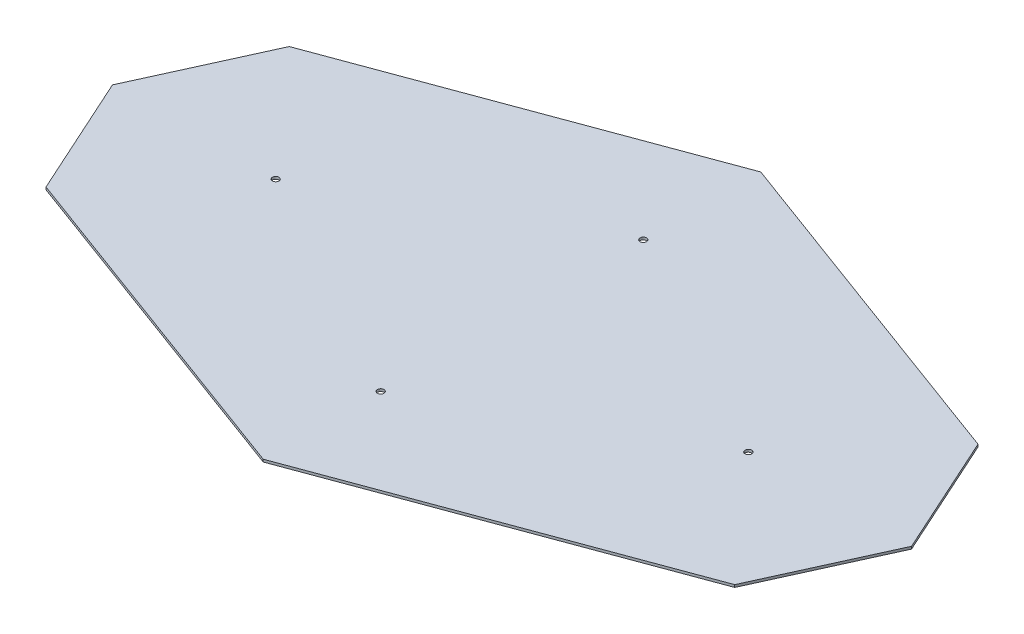
ISO-10303-21;
HEADER;
FILE_DESCRIPTION(('STEP AP214'),'2;1');
FILE_NAME('part.step','',(''),(''),'','','');
FILE_SCHEMA(('AUTOMOTIVE_DESIGN { 1 0 10303 214 1 1 1 1 }'));
ENDSEC;
DATA;
#1=APPLICATION_CONTEXT('core data for automotive mechanical design processes');
#2=APPLICATION_PROTOCOL_DEFINITION('international standard','automotive_design',2000,#1);
#3=PRODUCT_CONTEXT('',#1,'mechanical');
#4=PRODUCT('Part','Part','',(#3));
#5=PRODUCT_RELATED_PRODUCT_CATEGORY('part','',(#4));
#6=PRODUCT_DEFINITION_FORMATION('','',#4);
#7=PRODUCT_DEFINITION_CONTEXT('part definition',#1,'design');
#8=PRODUCT_DEFINITION('design','',#6,#7);
#9=PRODUCT_DEFINITION_SHAPE('','',#8);
#10=(LENGTH_UNIT() NAMED_UNIT(*) SI_UNIT(.MILLI.,.METRE.));
#11=(NAMED_UNIT(*) PLANE_ANGLE_UNIT() SI_UNIT($,.RADIAN.));
#12=(NAMED_UNIT(*) SI_UNIT($,.STERADIAN.) SOLID_ANGLE_UNIT());
#13=UNCERTAINTY_MEASURE_WITH_UNIT(LENGTH_MEASURE(1.E-05),#10,'distance_accuracy_value','');
#14=(GEOMETRIC_REPRESENTATION_CONTEXT(3) GLOBAL_UNCERTAINTY_ASSIGNED_CONTEXT((#13)) GLOBAL_UNIT_ASSIGNED_CONTEXT((#10,
#11,#12)) REPRESENTATION_CONTEXT('',''));
#15=CARTESIAN_POINT('',(0.,0.,0.));
#16=DIRECTION('',(0.,0.,1.));
#17=DIRECTION('',(1.,0.,0.));
#18=AXIS2_PLACEMENT_3D('',#15,#16,#17);
#19=CARTESIAN_POINT('',(-386.459013783552,1.190625,0.));
#20=DIRECTION('',(0.910635035926992,0.,0.413211606011068));
#21=DIRECTION('',(0.413211606011068,0.,-0.910635035926992));
#22=AXIS2_PLACEMENT_3D('',#19,#20,#21);
#23=PLANE('',#22);
#24=DIRECTION('',(-0.413211606011068,0.,0.910635035926992));
#25=VECTOR('',#24,1.);
#26=CARTESIAN_POINT('',(-386.459013783552,-1.190625,0.));
#27=LINE('',#26,#25);
#28=CARTESIAN_POINT('',(-333.074526412795,-1.190625,-117.648642650931));
#29=VERTEX_POINT('',#28);
#30=CARTESIAN_POINT('',(-386.459013783552,-1.190625,0.));
#31=VERTEX_POINT('',#30);
#32=EDGE_CURVE('E131',#29,#31,#27,.T.);
#33=ORIENTED_EDGE('',*,*,#32,.T.);
#34=DIRECTION('',(0.,-1.,0.));
#35=VECTOR('',#34,1.);
#36=CARTESIAN_POINT('',(-386.459013783552,1.190625,0.));
#37=LINE('',#36,#35);
#38=CARTESIAN_POINT('',(-386.459013783552,1.190625,0.));
#39=VERTEX_POINT('',#38);
#40=EDGE_CURVE('E11',#39,#31,#37,.T.);
#41=ORIENTED_EDGE('',*,*,#40,.F.);
#42=DIRECTION('',(-0.413211606011068,0.,0.910635035926992));
#43=VECTOR('',#42,1.);
#44=CARTESIAN_POINT('',(-386.459013783552,1.190625,0.));
#45=LINE('',#44,#43);
#46=CARTESIAN_POINT('',(-333.074526412795,1.190625,-117.648642650931));
#47=VERTEX_POINT('',#46);
#48=EDGE_CURVE('E146',#47,#39,#45,.T.);
#49=ORIENTED_EDGE('',*,*,#48,.F.);
#50=DIRECTION('',(0.,-1.,0.));
#51=VECTOR('',#50,1.);
#52=CARTESIAN_POINT('',(-333.074526412795,1.190625,-117.648642650931));
#53=LINE('',#52,#51);
#54=EDGE_CURVE('E127',#47,#29,#53,.T.);
#55=ORIENTED_EDGE('',*,*,#54,.T.);
#56=EDGE_LOOP('',(#33,#41,#49,#55));
#57=FACE_BOUND('',#56,.T.);
#58=ADVANCED_FACE('F35',(#57),#23,.F.);
#59=CARTESIAN_POINT('',(-386.459013783552,1.190625,0.));
#60=DIRECTION('',(0.910635035926992,0.,-0.413211606011068));
#61=DIRECTION('',(-0.413211606011068,0.,-0.910635035926992));
#62=AXIS2_PLACEMENT_3D('',#59,#60,#61);
#63=PLANE('',#62);
#64=DIRECTION('',(0.413211606011068,0.,0.910635035926992));
#65=VECTOR('',#64,1.);
#66=CARTESIAN_POINT('',(-386.459013783552,-1.190625,0.));
#67=LINE('',#66,#65);
#68=CARTESIAN_POINT('',(-333.074526412795,-1.190625,117.648642650931));
#69=VERTEX_POINT('',#68);
#70=EDGE_CURVE('E134',#31,#69,#67,.T.);
#71=ORIENTED_EDGE('',*,*,#70,.T.);
#72=DIRECTION('',(0.,-1.,0.));
#73=VECTOR('',#72,1.);
#74=CARTESIAN_POINT('',(-333.074526412795,1.190625,117.648642650931));
#75=LINE('',#74,#73);
#76=CARTESIAN_POINT('',(-333.074526412795,1.190625,117.648642650931));
#77=VERTEX_POINT('',#76);
#78=EDGE_CURVE('E43',#77,#69,#75,.T.);
#79=ORIENTED_EDGE('',*,*,#78,.F.);
#80=DIRECTION('',(0.413211606011068,0.,0.910635035926992));
#81=VECTOR('',#80,1.);
#82=CARTESIAN_POINT('',(-386.459013783552,1.190625,0.));
#83=LINE('',#82,#81);
#84=EDGE_CURVE('E94',#39,#77,#83,.T.);
#85=ORIENTED_EDGE('',*,*,#84,.F.);
#86=ORIENTED_EDGE('',*,*,#40,.T.);
#87=EDGE_LOOP('',(#71,#79,#85,#86));
#88=FACE_BOUND('',#87,.T.);
#89=ADVANCED_FACE('F236',(#88),#63,.F.);
#90=CARTESIAN_POINT('',(0.,1.190625,240.59792646948));
#91=DIRECTION('',(0.346294567064101,0.,-0.938125829951338));
#92=DIRECTION('',(-0.938125829951338,0.,-0.346294567064101));
#93=AXIS2_PLACEMENT_3D('',#90,#91,#92);
#94=PLANE('',#93);
#95=DIRECTION('',(0.938125829951338,0.,0.346294567064101));
#96=VECTOR('',#95,1.);
#97=CARTESIAN_POINT('',(0.,-1.190625,240.59792646948));
#98=LINE('',#97,#96);
#99=CARTESIAN_POINT('',(0.,-1.190625,240.59792646948));
#100=VERTEX_POINT('',#99);
#101=EDGE_CURVE('E137',#69,#100,#98,.T.);
#102=ORIENTED_EDGE('',*,*,#101,.T.);
#103=DIRECTION('',(0.,-1.,0.));
#104=VECTOR('',#103,1.);
#105=CARTESIAN_POINT('',(0.,1.190625,240.59792646948));
#106=LINE('',#105,#104);
#107=CARTESIAN_POINT('',(0.,1.190625,240.59792646948));
#108=VERTEX_POINT('',#107);
#109=EDGE_CURVE('E153',#108,#100,#106,.T.);
#110=ORIENTED_EDGE('',*,*,#109,.F.);
#111=DIRECTION('',(0.938125829951338,0.,0.346294567064101));
#112=VECTOR('',#111,1.);
#113=CARTESIAN_POINT('',(0.,1.190625,240.59792646948));
#114=LINE('',#113,#112);
#115=EDGE_CURVE('E161',#77,#108,#114,.T.);
#116=ORIENTED_EDGE('',*,*,#115,.F.);
#117=ORIENTED_EDGE('',*,*,#78,.T.);
#118=EDGE_LOOP('',(#102,#110,#116,#117));
#119=FACE_BOUND('',#118,.T.);
#120=ADVANCED_FACE('F159',(#119),#94,.F.);
#121=CARTESIAN_POINT('',(333.074526412795,1.190625,117.648642650931));
#122=DIRECTION('',(-0.3462945670641,0.,-0.938125829951338));
#123=DIRECTION('',(-0.938125829951338,0.,0.3462945670641));
#124=AXIS2_PLACEMENT_3D('',#121,#122,#123);
#125=PLANE('',#124);
#126=DIRECTION('',(0.938125829951338,0.,-0.346294567064101));
#127=VECTOR('',#126,1.);
#128=CARTESIAN_POINT('',(333.074526412795,-1.190625,117.648642650931));
#129=LINE('',#128,#127);
#130=CARTESIAN_POINT('',(333.074526412795,-1.190625,117.648642650931));
#131=VERTEX_POINT('',#130);
#132=EDGE_CURVE('E139',#100,#131,#129,.T.);
#133=ORIENTED_EDGE('',*,*,#132,.T.);
#134=DIRECTION('',(0.,-1.,0.));
#135=VECTOR('',#134,1.);
#136=CARTESIAN_POINT('',(333.074526412795,1.190625,117.648642650931));
#137=LINE('',#136,#135);
#138=CARTESIAN_POINT('',(333.074526412795,1.190625,117.648642650931));
#139=VERTEX_POINT('',#138);
#140=EDGE_CURVE('E150',#139,#131,#137,.T.);
#141=ORIENTED_EDGE('',*,*,#140,.F.);
#142=DIRECTION('',(0.938125829951338,0.,-0.346294567064101));
#143=VECTOR('',#142,1.);
#144=CARTESIAN_POINT('',(333.074526412795,1.190625,117.648642650931));
#145=LINE('',#144,#143);
#146=EDGE_CURVE('E173',#108,#139,#145,.T.);
#147=ORIENTED_EDGE('',*,*,#146,.F.);
#148=ORIENTED_EDGE('',*,*,#109,.T.);
#149=EDGE_LOOP('',(#133,#141,#147,#148));
#150=FACE_BOUND('',#149,.T.);
#151=ADVANCED_FACE('F169',(#150),#125,.F.);
#152=CARTESIAN_POINT('',(386.459013783552,1.190625,0.));
#153=DIRECTION('',(-0.910635035926992,0.,-0.413211606011068));
#154=DIRECTION('',(-0.413211606011068,0.,0.910635035926992));
#155=AXIS2_PLACEMENT_3D('',#152,#153,#154);
#156=PLANE('',#155);
#157=DIRECTION('',(0.413211606011068,0.,-0.910635035926992));
#158=VECTOR('',#157,1.);
#159=CARTESIAN_POINT('',(386.459013783552,-1.190625,0.));
#160=LINE('',#159,#158);
#161=CARTESIAN_POINT('',(386.459013783552,-1.190625,0.));
#162=VERTEX_POINT('',#161);
#163=EDGE_CURVE('E141',#131,#162,#160,.T.);
#164=ORIENTED_EDGE('',*,*,#163,.T.);
#165=DIRECTION('',(0.,-1.,0.));
#166=VECTOR('',#165,1.);
#167=CARTESIAN_POINT('',(386.459013783552,1.190625,0.));
#168=LINE('',#167,#166);
#169=CARTESIAN_POINT('',(386.459013783552,1.190625,0.));
#170=VERTEX_POINT('',#169);
#171=EDGE_CURVE('E122',#170,#162,#168,.T.);
#172=ORIENTED_EDGE('',*,*,#171,.F.);
#173=DIRECTION('',(0.413211606011068,0.,-0.910635035926992));
#174=VECTOR('',#173,1.);
#175=CARTESIAN_POINT('',(386.459013783552,1.190625,0.));
#176=LINE('',#175,#174);
#177=EDGE_CURVE('E113',#139,#170,#176,.T.);
#178=ORIENTED_EDGE('',*,*,#177,.F.);
#179=ORIENTED_EDGE('',*,*,#140,.T.);
#180=EDGE_LOOP('',(#164,#172,#178,#179));
#181=FACE_BOUND('',#180,.T.);
#182=ADVANCED_FACE('F172',(#181),#156,.F.);
#183=CARTESIAN_POINT('',(333.074526412795,1.190625,-117.648642650931));
#184=DIRECTION('',(-0.910635035926992,0.,0.413211606011068));
#185=DIRECTION('',(0.413211606011068,0.,0.910635035926992));
#186=AXIS2_PLACEMENT_3D('',#183,#184,#185);
#187=PLANE('',#186);
#188=DIRECTION('',(-0.413211606011068,0.,-0.910635035926992));
#189=VECTOR('',#188,1.);
#190=CARTESIAN_POINT('',(333.074526412795,-1.190625,-117.648642650931));
#191=LINE('',#190,#189);
#192=CARTESIAN_POINT('',(333.074526412795,-1.190625,-117.648642650931));
#193=VERTEX_POINT('',#192);
#194=EDGE_CURVE('E121',#162,#193,#191,.T.);
#195=ORIENTED_EDGE('',*,*,#194,.T.);
#196=DIRECTION('',(0.,-1.,0.));
#197=VECTOR('',#196,1.);
#198=CARTESIAN_POINT('',(333.074526412795,1.190625,-117.648642650931));
#199=LINE('',#198,#197);
#200=CARTESIAN_POINT('',(333.074526412795,1.190625,-117.648642650931));
#201=VERTEX_POINT('',#200);
#202=EDGE_CURVE('E118',#201,#193,#199,.T.);
#203=ORIENTED_EDGE('',*,*,#202,.F.);
#204=DIRECTION('',(-0.413211606011068,0.,-0.910635035926992));
#205=VECTOR('',#204,1.);
#206=CARTESIAN_POINT('',(333.074526412795,1.190625,-117.648642650931));
#207=LINE('',#206,#205);
#208=EDGE_CURVE('E107',#170,#201,#207,.T.);
#209=ORIENTED_EDGE('',*,*,#208,.F.);
#210=ORIENTED_EDGE('',*,*,#171,.T.);
#211=EDGE_LOOP('',(#195,#203,#209,#210));
#212=FACE_BOUND('',#211,.T.);
#213=ADVANCED_FACE('F119',(#212),#187,.F.);
#214=CARTESIAN_POINT('',(0.,1.190625,-240.59792646948));
#215=DIRECTION('',(-0.3462945670641,0.,0.938125829951338));
#216=DIRECTION('',(0.938125829951339,0.,0.3462945670641));
#217=AXIS2_PLACEMENT_3D('',#214,#215,#216);
#218=PLANE('',#217);
#219=DIRECTION('',(-0.938125829951338,0.,-0.3462945670641));
#220=VECTOR('',#219,1.);
#221=CARTESIAN_POINT('',(0.,-1.190625,-240.59792646948));
#222=LINE('',#221,#220);
#223=CARTESIAN_POINT('',(0.,-1.190625,-240.59792646948));
#224=VERTEX_POINT('',#223);
#225=EDGE_CURVE('E80',#193,#224,#222,.T.);
#226=ORIENTED_EDGE('',*,*,#225,.T.);
#227=DIRECTION('',(0.,-1.,0.));
#228=VECTOR('',#227,1.);
#229=CARTESIAN_POINT('',(0.,1.190625,-240.59792646948));
#230=LINE('',#229,#228);
#231=CARTESIAN_POINT('',(0.,1.190625,-240.59792646948));
#232=VERTEX_POINT('',#231);
#233=EDGE_CURVE('E123',#232,#224,#230,.T.);
#234=ORIENTED_EDGE('',*,*,#233,.F.);
#235=DIRECTION('',(-0.938125829951338,0.,-0.3462945670641));
#236=VECTOR('',#235,1.);
#237=CARTESIAN_POINT('',(0.,1.190625,-240.59792646948));
#238=LINE('',#237,#236);
#239=EDGE_CURVE('E111',#201,#232,#238,.T.);
#240=ORIENTED_EDGE('',*,*,#239,.F.);
#241=ORIENTED_EDGE('',*,*,#202,.T.);
#242=EDGE_LOOP('',(#226,#234,#240,#241));
#243=FACE_BOUND('',#242,.T.);
#244=ADVANCED_FACE('F125',(#243),#218,.F.);
#245=CARTESIAN_POINT('',(-333.074526412795,1.190625,-117.648642650931));
#246=DIRECTION('',(0.3462945670641,0.,0.938125829951338));
#247=DIRECTION('',(0.938125829951339,0.,-0.3462945670641));
#248=AXIS2_PLACEMENT_3D('',#245,#246,#247);
#249=PLANE('',#248);
#250=DIRECTION('',(-0.938125829951338,0.,0.3462945670641));
#251=VECTOR('',#250,1.);
#252=CARTESIAN_POINT('',(-333.074526412795,-1.190625,-117.648642650931));
#253=LINE('',#252,#251);
#254=EDGE_CURVE('E86',#224,#29,#253,.T.);
#255=ORIENTED_EDGE('',*,*,#254,.T.);
#256=ORIENTED_EDGE('',*,*,#54,.F.);
#257=DIRECTION('',(-0.938125829951338,0.,0.3462945670641));
#258=VECTOR('',#257,1.);
#259=CARTESIAN_POINT('',(-333.074526412795,1.190625,-117.648642650931));
#260=LINE('',#259,#258);
#261=EDGE_CURVE('E51',#232,#47,#260,.T.);
#262=ORIENTED_EDGE('',*,*,#261,.F.);
#263=ORIENTED_EDGE('',*,*,#233,.T.);
#264=EDGE_LOOP('',(#255,#256,#262,#263));
#265=FACE_BOUND('',#264,.T.);
#266=ADVANCED_FACE('F214',(#265),#249,.F.);
#267=CARTESIAN_POINT('',(0.,1.190625,0.));
#268=DIRECTION('',(0.,-1.,0.));
#269=DIRECTION('',(0.,0.,-1.));
#270=AXIS2_PLACEMENT_3D('',#267,#268,#269);
#271=PLANE('',#270);
#272=CARTESIAN_POINT('',(228.6,1.190625,0.));
#273=DIRECTION('',(0.,1.,0.));
#274=DIRECTION('',(-1.,0.,0.));
#275=AXIS2_PLACEMENT_3D('',#272,#273,#274);
#276=CIRCLE('',#275,3.175);
#277=CARTESIAN_POINT('',(228.6,1.190625,3.17499999999999));
#278=VERTEX_POINT('',#277);
#279=EDGE_CURVE('E197',#278,#278,#276,.T.);
#280=ORIENTED_EDGE('',*,*,#279,.F.);
#281=EDGE_LOOP('',(#280));
#282=FACE_BOUND('',#281,.T.);
#283=CARTESIAN_POINT('',(0.,1.190625,127.));
#284=DIRECTION('',(0.,1.,0.));
#285=DIRECTION('',(0.,0.,-1.));
#286=AXIS2_PLACEMENT_3D('',#283,#284,#285);
#287=CIRCLE('',#286,3.175);
#288=CARTESIAN_POINT('',(0.,1.190625,130.175));
#289=VERTEX_POINT('',#288);
#290=EDGE_CURVE('E191',#289,#289,#287,.T.);
#291=ORIENTED_EDGE('',*,*,#290,.F.);
#292=EDGE_LOOP('',(#291));
#293=FACE_BOUND('',#292,.T.);
#294=CARTESIAN_POINT('',(-228.6,1.190625,0.));
#295=DIRECTION('',(0.,1.,0.));
#296=DIRECTION('',(1.,0.,0.));
#297=AXIS2_PLACEMENT_3D('',#294,#295,#296);
#298=CIRCLE('',#297,3.175);
#299=CARTESIAN_POINT('',(-228.6,1.190625,3.17499999999996));
#300=VERTEX_POINT('',#299);
#301=EDGE_CURVE('E185',#300,#300,#298,.T.);
#302=ORIENTED_EDGE('',*,*,#301,.F.);
#303=EDGE_LOOP('',(#302));
#304=FACE_BOUND('',#303,.T.);
#305=CARTESIAN_POINT('',(0.,1.190625,-127.));
#306=DIRECTION('',(0.,1.,0.));
#307=DIRECTION('',(0.,0.,1.));
#308=AXIS2_PLACEMENT_3D('',#305,#306,#307);
#309=CIRCLE('',#308,3.175);
#310=CARTESIAN_POINT('',(0.,1.190625,-123.825));
#311=VERTEX_POINT('',#310);
#312=EDGE_CURVE('E179',#311,#311,#309,.T.);
#313=ORIENTED_EDGE('',*,*,#312,.F.);
#314=EDGE_LOOP('',(#313));
#315=FACE_BOUND('',#314,.T.);
#316=ORIENTED_EDGE('',*,*,#48,.T.);
#317=ORIENTED_EDGE('',*,*,#84,.T.);
#318=ORIENTED_EDGE('',*,*,#115,.T.);
#319=ORIENTED_EDGE('',*,*,#146,.T.);
#320=ORIENTED_EDGE('',*,*,#177,.T.);
#321=ORIENTED_EDGE('',*,*,#208,.T.);
#322=ORIENTED_EDGE('',*,*,#239,.T.);
#323=ORIENTED_EDGE('',*,*,#261,.T.);
#324=EDGE_LOOP('',(#316,#317,#318,#319,#320,#321,#322,#323));
#325=FACE_BOUND('',#324,.T.);
#326=ADVANCED_FACE('F109',(#282,#293,#304,#315,#325),#271,.F.);
#327=CARTESIAN_POINT('',(0.,-1.190625,0.));
#328=DIRECTION('',(0.,-1.,0.));
#329=DIRECTION('',(0.,0.,-1.));
#330=AXIS2_PLACEMENT_3D('',#327,#328,#329);
#331=PLANE('',#330);
#332=CARTESIAN_POINT('',(228.6,-1.190625,0.));
#333=DIRECTION('',(0.,1.,0.));
#334=DIRECTION('',(-1.,0.,0.));
#335=AXIS2_PLACEMENT_3D('',#332,#333,#334);
#336=CIRCLE('',#335,3.175);
#337=CARTESIAN_POINT('',(228.6,-1.190625,3.17499999999999));
#338=VERTEX_POINT('',#337);
#339=EDGE_CURVE('E194',#338,#338,#336,.T.);
#340=ORIENTED_EDGE('',*,*,#339,.T.);
#341=EDGE_LOOP('',(#340));
#342=FACE_BOUND('',#341,.T.);
#343=CARTESIAN_POINT('',(0.,-1.190625,127.));
#344=DIRECTION('',(0.,1.,0.));
#345=DIRECTION('',(0.,0.,-1.));
#346=AXIS2_PLACEMENT_3D('',#343,#344,#345);
#347=CIRCLE('',#346,3.175);
#348=CARTESIAN_POINT('',(0.,-1.190625,130.175));
#349=VERTEX_POINT('',#348);
#350=EDGE_CURVE('E188',#349,#349,#347,.T.);
#351=ORIENTED_EDGE('',*,*,#350,.T.);
#352=EDGE_LOOP('',(#351));
#353=FACE_BOUND('',#352,.T.);
#354=CARTESIAN_POINT('',(-228.6,-1.190625,0.));
#355=DIRECTION('',(0.,1.,0.));
#356=DIRECTION('',(1.,0.,0.));
#357=AXIS2_PLACEMENT_3D('',#354,#355,#356);
#358=CIRCLE('',#357,3.175);
#359=CARTESIAN_POINT('',(-228.6,-1.190625,3.17499999999996));
#360=VERTEX_POINT('',#359);
#361=EDGE_CURVE('E182',#360,#360,#358,.T.);
#362=ORIENTED_EDGE('',*,*,#361,.T.);
#363=EDGE_LOOP('',(#362));
#364=FACE_BOUND('',#363,.T.);
#365=CARTESIAN_POINT('',(0.,-1.190625,-127.));
#366=DIRECTION('',(0.,1.,0.));
#367=DIRECTION('',(0.,0.,1.));
#368=AXIS2_PLACEMENT_3D('',#365,#366,#367);
#369=CIRCLE('',#368,3.175);
#370=CARTESIAN_POINT('',(0.,-1.190625,-123.825));
#371=VERTEX_POINT('',#370);
#372=EDGE_CURVE('E135',#371,#371,#369,.T.);
#373=ORIENTED_EDGE('',*,*,#372,.T.);
#374=EDGE_LOOP('',(#373));
#375=FACE_BOUND('',#374,.T.);
#376=ORIENTED_EDGE('',*,*,#32,.F.);
#377=ORIENTED_EDGE('',*,*,#254,.F.);
#378=ORIENTED_EDGE('',*,*,#225,.F.);
#379=ORIENTED_EDGE('',*,*,#194,.F.);
#380=ORIENTED_EDGE('',*,*,#163,.F.);
#381=ORIENTED_EDGE('',*,*,#132,.F.);
#382=ORIENTED_EDGE('',*,*,#101,.F.);
#383=ORIENTED_EDGE('',*,*,#70,.F.);
#384=EDGE_LOOP('',(#376,#377,#378,#379,#380,#381,#382,#383));
#385=FACE_BOUND('',#384,.T.);
#386=ADVANCED_FACE('F165',(#342,#353,#364,#375,#385),#331,.T.);
#387=CARTESIAN_POINT('',(0.,-1.190625,-127.));
#388=DIRECTION('',(0.,1.,0.));
#389=DIRECTION('',(0.,0.,1.));
#390=AXIS2_PLACEMENT_3D('',#387,#388,#389);
#391=CYLINDRICAL_SURFACE('',#390,3.175);
#392=CARTESIAN_POINT('',(0.,-1.190625,-123.825));
#393=CARTESIAN_POINT('',(0.,-1.1658203125,-123.825));
#394=CARTESIAN_POINT('',(0.,-1.141015625,-123.825));
#395=CARTESIAN_POINT('',(0.,-1.09140625,-123.825));
#396=CARTESIAN_POINT('',(0.,-1.0666015625,-123.825));
#397=CARTESIAN_POINT('',(0.,-1.0169921875,-123.825));
#398=CARTESIAN_POINT('',(0.,-0.9921875,-123.825));
#399=CARTESIAN_POINT('',(0.,-0.942578125,-123.825));
#400=CARTESIAN_POINT('',(0.,-0.9177734375,-123.825));
#401=CARTESIAN_POINT('',(0.,-0.8681640625,-123.825));
#402=CARTESIAN_POINT('',(0.,-0.843359375,-123.825));
#403=CARTESIAN_POINT('',(0.,-0.79375,-123.825));
#404=CARTESIAN_POINT('',(0.,-0.7689453125,-123.825));
#405=CARTESIAN_POINT('',(0.,-0.7193359375,-123.825));
#406=CARTESIAN_POINT('',(0.,-0.69453125,-123.825));
#407=CARTESIAN_POINT('',(0.,-0.644921875,-123.825));
#408=CARTESIAN_POINT('',(0.,-0.6201171875,-123.825));
#409=CARTESIAN_POINT('',(0.,-0.5705078125,-123.825));
#410=CARTESIAN_POINT('',(0.,-0.545703125,-123.825));
#411=CARTESIAN_POINT('',(0.,-0.49609375,-123.825));
#412=CARTESIAN_POINT('',(0.,-0.4712890625,-123.825));
#413=CARTESIAN_POINT('',(0.,-0.4216796875,-123.825));
#414=CARTESIAN_POINT('',(0.,-0.396875,-123.825));
#415=CARTESIAN_POINT('',(0.,-0.347265625,-123.825));
#416=CARTESIAN_POINT('',(0.,-0.3224609375,-123.825));
#417=CARTESIAN_POINT('',(0.,-0.2728515625,-123.825));
#418=CARTESIAN_POINT('',(0.,-0.248046875,-123.825));
#419=CARTESIAN_POINT('',(0.,-0.1984375,-123.825));
#420=CARTESIAN_POINT('',(0.,-0.1736328125,-123.825));
#421=CARTESIAN_POINT('',(0.,-0.1240234375,-123.825));
#422=CARTESIAN_POINT('',(0.,-0.0992187500000003,-123.825));
#423=CARTESIAN_POINT('',(0.,-0.0496093750000002,-123.825));
#424=CARTESIAN_POINT('',(0.,-0.0248046875000002,-123.825));
#425=CARTESIAN_POINT('',(0.,0.0248046874999998,-123.825));
#426=CARTESIAN_POINT('',(0.,0.0496093749999998,-123.825));
#427=CARTESIAN_POINT('',(0.,0.0992187499999998,-123.825));
#428=CARTESIAN_POINT('',(0.,0.1240234375,-123.825));
#429=CARTESIAN_POINT('',(0.,0.1736328125,-123.825));
#430=CARTESIAN_POINT('',(0.,0.1984375,-123.825));
#431=CARTESIAN_POINT('',(0.,0.248046875,-123.825));
#432=CARTESIAN_POINT('',(0.,0.2728515625,-123.825));
#433=CARTESIAN_POINT('',(0.,0.3224609375,-123.825));
#434=CARTESIAN_POINT('',(0.,0.347265625,-123.825));
#435=CARTESIAN_POINT('',(0.,0.396875,-123.825));
#436=CARTESIAN_POINT('',(0.,0.4216796875,-123.825));
#437=CARTESIAN_POINT('',(0.,0.4712890625,-123.825));
#438=CARTESIAN_POINT('',(0.,0.49609375,-123.825));
#439=CARTESIAN_POINT('',(0.,0.545703125,-123.825));
#440=CARTESIAN_POINT('',(0.,0.5705078125,-123.825));
#441=CARTESIAN_POINT('',(0.,0.6201171875,-123.825));
#442=CARTESIAN_POINT('',(0.,0.644921875,-123.825));
#443=CARTESIAN_POINT('',(0.,0.69453125,-123.825));
#444=CARTESIAN_POINT('',(0.,0.7193359375,-123.825));
#445=CARTESIAN_POINT('',(0.,0.7689453125,-123.825));
#446=CARTESIAN_POINT('',(0.,0.79375,-123.825));
#447=CARTESIAN_POINT('',(0.,0.843359375,-123.825));
#448=CARTESIAN_POINT('',(0.,0.8681640625,-123.825));
#449=CARTESIAN_POINT('',(0.,0.9177734375,-123.825));
#450=CARTESIAN_POINT('',(0.,0.942578125,-123.825));
#451=CARTESIAN_POINT('',(0.,0.9921875,-123.825));
#452=CARTESIAN_POINT('',(0.,1.0169921875,-123.825));
#453=CARTESIAN_POINT('',(0.,1.0666015625,-123.825));
#454=CARTESIAN_POINT('',(0.,1.09140625,-123.825));
#455=CARTESIAN_POINT('',(0.,1.141015625,-123.825));
#456=CARTESIAN_POINT('',(0.,1.1658203125,-123.825));
#457=CARTESIAN_POINT('',(0.,1.190625,-123.825));
#458=B_SPLINE_CURVE_WITH_KNOTS('',3,(#392,#393,#394,#395,#396,#397,#398,#399,#400,#401,#402,
#403,#404,#405,#406,#407,#408,#409,#410,#411,#412,#413,#414,#415,#416,#417,#418,#419,#420,#421,
#422,#423,#424,#425,#426,#427,#428,#429,#430,#431,#432,#433,#434,#435,#436,#437,#438,#439,#440,
#441,#442,#443,#444,#445,#446,#447,#448,#449,#450,#451,#452,#453,#454,#455,#456,#457),
.UNSPECIFIED.,.F.,.F.,(4,2,2,2,2,2,2,2,2,2,2,2,2,2,2,2,2,2,2,2,2,2,2,2,2,2,2,2,2,2,2,2,4),(0.,
0.0744140625,0.148828125,0.2232421875,0.29765625,0.3720703125,0.446484375,0.5208984375,
0.5953125,0.6697265625,0.744140625,0.8185546875,0.89296875,0.9673828125,1.041796875,
1.1162109375,1.190625,1.2650390625,1.339453125,1.4138671875,1.48828125,1.5626953125,1.637109375,
1.7115234375,1.7859375,1.8603515625,1.934765625,2.0091796875,2.08359375,2.1580078125,
2.232421875,2.3068359375,2.38125),.UNSPECIFIED.);
#459=EDGE_CURVE('BSEAM222',#371,#311,#458,.T.);
#460=ORIENTED_EDGE('',*,*,#372,.F.);
#461=ORIENTED_EDGE('',*,*,#312,.T.);
#462=ORIENTED_EDGE('',*,*,#459,.T.);
#463=ORIENTED_EDGE('',*,*,#459,.F.);
#464=EDGE_LOOP('',(#460,#462,#461,#463));
#465=FACE_BOUND('',#464,.T.);
#466=ADVANCED_FACE('F222',(#465),#391,.F.);
#467=CARTESIAN_POINT('',(-228.6,-1.190625,0.));
#468=DIRECTION('',(0.,1.,0.));
#469=DIRECTION('',(0.,0.,1.));
#470=AXIS2_PLACEMENT_3D('',#467,#468,#469);
#471=CYLINDRICAL_SURFACE('',#470,3.175);
#472=CARTESIAN_POINT('',(-228.6,-1.190625,3.17499999999996));
#473=CARTESIAN_POINT('',(-228.6,-1.1658203125,3.17499999999996));
#474=CARTESIAN_POINT('',(-228.6,-1.141015625,3.17499999999996));
#475=CARTESIAN_POINT('',(-228.6,-1.09140625,3.17499999999996));
#476=CARTESIAN_POINT('',(-228.6,-1.0666015625,3.17499999999996));
#477=CARTESIAN_POINT('',(-228.6,-1.0169921875,3.17499999999996));
#478=CARTESIAN_POINT('',(-228.6,-0.9921875,3.17499999999996));
#479=CARTESIAN_POINT('',(-228.6,-0.942578125,3.17499999999996));
#480=CARTESIAN_POINT('',(-228.6,-0.9177734375,3.17499999999996));
#481=CARTESIAN_POINT('',(-228.6,-0.8681640625,3.17499999999996));
#482=CARTESIAN_POINT('',(-228.6,-0.843359375,3.17499999999996));
#483=CARTESIAN_POINT('',(-228.6,-0.79375,3.17499999999996));
#484=CARTESIAN_POINT('',(-228.6,-0.7689453125,3.17499999999996));
#485=CARTESIAN_POINT('',(-228.6,-0.7193359375,3.17499999999996));
#486=CARTESIAN_POINT('',(-228.6,-0.69453125,3.17499999999996));
#487=CARTESIAN_POINT('',(-228.6,-0.644921875,3.17499999999996));
#488=CARTESIAN_POINT('',(-228.6,-0.6201171875,3.17499999999996));
#489=CARTESIAN_POINT('',(-228.6,-0.5705078125,3.17499999999996));
#490=CARTESIAN_POINT('',(-228.6,-0.545703125,3.17499999999996));
#491=CARTESIAN_POINT('',(-228.6,-0.49609375,3.17499999999996));
#492=CARTESIAN_POINT('',(-228.6,-0.4712890625,3.17499999999996));
#493=CARTESIAN_POINT('',(-228.6,-0.4216796875,3.17499999999996));
#494=CARTESIAN_POINT('',(-228.6,-0.396875,3.17499999999996));
#495=CARTESIAN_POINT('',(-228.6,-0.347265625,3.17499999999996));
#496=CARTESIAN_POINT('',(-228.6,-0.3224609375,3.17499999999996));
#497=CARTESIAN_POINT('',(-228.6,-0.2728515625,3.17499999999996));
#498=CARTESIAN_POINT('',(-228.6,-0.248046875,3.17499999999996));
#499=CARTESIAN_POINT('',(-228.6,-0.1984375,3.17499999999996));
#500=CARTESIAN_POINT('',(-228.6,-0.1736328125,3.17499999999996));
#501=CARTESIAN_POINT('',(-228.6,-0.1240234375,3.17499999999996));
#502=CARTESIAN_POINT('',(-228.6,-0.0992187500000003,3.17499999999996));
#503=CARTESIAN_POINT('',(-228.6,-0.0496093750000002,3.17499999999996));
#504=CARTESIAN_POINT('',(-228.6,-0.0248046875000002,3.17499999999996));
#505=CARTESIAN_POINT('',(-228.6,0.0248046874999998,3.17499999999996));
#506=CARTESIAN_POINT('',(-228.6,0.0496093749999998,3.17499999999996));
#507=CARTESIAN_POINT('',(-228.6,0.0992187499999998,3.17499999999996));
#508=CARTESIAN_POINT('',(-228.6,0.1240234375,3.17499999999996));
#509=CARTESIAN_POINT('',(-228.6,0.1736328125,3.17499999999996));
#510=CARTESIAN_POINT('',(-228.6,0.1984375,3.17499999999996));
#511=CARTESIAN_POINT('',(-228.6,0.248046875,3.17499999999996));
#512=CARTESIAN_POINT('',(-228.6,0.2728515625,3.17499999999996));
#513=CARTESIAN_POINT('',(-228.6,0.3224609375,3.17499999999996));
#514=CARTESIAN_POINT('',(-228.6,0.347265625,3.17499999999996));
#515=CARTESIAN_POINT('',(-228.6,0.396875,3.17499999999996));
#516=CARTESIAN_POINT('',(-228.6,0.4216796875,3.17499999999996));
#517=CARTESIAN_POINT('',(-228.6,0.4712890625,3.17499999999996));
#518=CARTESIAN_POINT('',(-228.6,0.49609375,3.17499999999996));
#519=CARTESIAN_POINT('',(-228.6,0.545703125,3.17499999999996));
#520=CARTESIAN_POINT('',(-228.6,0.5705078125,3.17499999999996));
#521=CARTESIAN_POINT('',(-228.6,0.6201171875,3.17499999999996));
#522=CARTESIAN_POINT('',(-228.6,0.644921875,3.17499999999996));
#523=CARTESIAN_POINT('',(-228.6,0.69453125,3.17499999999996));
#524=CARTESIAN_POINT('',(-228.6,0.7193359375,3.17499999999996));
#525=CARTESIAN_POINT('',(-228.6,0.7689453125,3.17499999999996));
#526=CARTESIAN_POINT('',(-228.6,0.79375,3.17499999999996));
#527=CARTESIAN_POINT('',(-228.6,0.843359375,3.17499999999996));
#528=CARTESIAN_POINT('',(-228.6,0.8681640625,3.17499999999996));
#529=CARTESIAN_POINT('',(-228.6,0.9177734375,3.17499999999996));
#530=CARTESIAN_POINT('',(-228.6,0.942578125,3.17499999999996));
#531=CARTESIAN_POINT('',(-228.6,0.9921875,3.17499999999996));
#532=CARTESIAN_POINT('',(-228.6,1.0169921875,3.17499999999996));
#533=CARTESIAN_POINT('',(-228.6,1.0666015625,3.17499999999996));
#534=CARTESIAN_POINT('',(-228.6,1.09140625,3.17499999999996));
#535=CARTESIAN_POINT('',(-228.6,1.141015625,3.17499999999996));
#536=CARTESIAN_POINT('',(-228.6,1.1658203125,3.17499999999996));
#537=CARTESIAN_POINT('',(-228.6,1.190625,3.17499999999996));
#538=B_SPLINE_CURVE_WITH_KNOTS('',3,(#472,#473,#474,#475,#476,#477,#478,#479,#480,#481,#482,
#483,#484,#485,#486,#487,#488,#489,#490,#491,#492,#493,#494,#495,#496,#497,#498,#499,#500,#501,
#502,#503,#504,#505,#506,#507,#508,#509,#510,#511,#512,#513,#514,#515,#516,#517,#518,#519,#520,
#521,#522,#523,#524,#525,#526,#527,#528,#529,#530,#531,#532,#533,#534,#535,#536,#537),
.UNSPECIFIED.,.F.,.F.,(4,2,2,2,2,2,2,2,2,2,2,2,2,2,2,2,2,2,2,2,2,2,2,2,2,2,2,2,2,2,2,2,4),(0.,
0.0744140625,0.148828125,0.2232421875,0.29765625,0.3720703125,0.446484375,0.5208984375,
0.5953125,0.6697265625,0.744140625,0.8185546875,0.89296875,0.9673828125,1.041796875,
1.1162109375,1.190625,1.2650390625,1.339453125,1.4138671875,1.48828125,1.5626953125,1.637109375,
1.7115234375,1.7859375,1.8603515625,1.934765625,2.0091796875,2.08359375,2.1580078125,
2.232421875,2.3068359375,2.38125),.UNSPECIFIED.);
#539=EDGE_CURVE('BSEAM224',#360,#300,#538,.T.);
#540=ORIENTED_EDGE('',*,*,#361,.F.);
#541=ORIENTED_EDGE('',*,*,#301,.T.);
#542=ORIENTED_EDGE('',*,*,#539,.T.);
#543=ORIENTED_EDGE('',*,*,#539,.F.);
#544=EDGE_LOOP('',(#540,#542,#541,#543));
#545=FACE_BOUND('',#544,.T.);
#546=ADVANCED_FACE('F224',(#545),#471,.F.);
#547=CARTESIAN_POINT('',(0.,-1.190625,127.));
#548=DIRECTION('',(0.,1.,0.));
#549=DIRECTION('',(0.,0.,1.));
#550=AXIS2_PLACEMENT_3D('',#547,#548,#549);
#551=CYLINDRICAL_SURFACE('',#550,3.175);
#552=CARTESIAN_POINT('',(0.,-1.190625,130.175));
#553=CARTESIAN_POINT('',(0.,-1.1658203125,130.175));
#554=CARTESIAN_POINT('',(0.,-1.141015625,130.175));
#555=CARTESIAN_POINT('',(0.,-1.09140625,130.175));
#556=CARTESIAN_POINT('',(0.,-1.0666015625,130.175));
#557=CARTESIAN_POINT('',(0.,-1.0169921875,130.175));
#558=CARTESIAN_POINT('',(0.,-0.9921875,130.175));
#559=CARTESIAN_POINT('',(0.,-0.942578125,130.175));
#560=CARTESIAN_POINT('',(0.,-0.9177734375,130.175));
#561=CARTESIAN_POINT('',(0.,-0.8681640625,130.175));
#562=CARTESIAN_POINT('',(0.,-0.843359375,130.175));
#563=CARTESIAN_POINT('',(0.,-0.79375,130.175));
#564=CARTESIAN_POINT('',(0.,-0.7689453125,130.175));
#565=CARTESIAN_POINT('',(0.,-0.7193359375,130.175));
#566=CARTESIAN_POINT('',(0.,-0.69453125,130.175));
#567=CARTESIAN_POINT('',(0.,-0.644921875,130.175));
#568=CARTESIAN_POINT('',(0.,-0.6201171875,130.175));
#569=CARTESIAN_POINT('',(0.,-0.5705078125,130.175));
#570=CARTESIAN_POINT('',(0.,-0.545703125,130.175));
#571=CARTESIAN_POINT('',(0.,-0.49609375,130.175));
#572=CARTESIAN_POINT('',(0.,-0.4712890625,130.175));
#573=CARTESIAN_POINT('',(0.,-0.4216796875,130.175));
#574=CARTESIAN_POINT('',(0.,-0.396875,130.175));
#575=CARTESIAN_POINT('',(0.,-0.347265625,130.175));
#576=CARTESIAN_POINT('',(0.,-0.3224609375,130.175));
#577=CARTESIAN_POINT('',(0.,-0.2728515625,130.175));
#578=CARTESIAN_POINT('',(0.,-0.248046875,130.175));
#579=CARTESIAN_POINT('',(0.,-0.1984375,130.175));
#580=CARTESIAN_POINT('',(0.,-0.1736328125,130.175));
#581=CARTESIAN_POINT('',(0.,-0.1240234375,130.175));
#582=CARTESIAN_POINT('',(0.,-0.0992187500000003,130.175));
#583=CARTESIAN_POINT('',(0.,-0.0496093750000002,130.175));
#584=CARTESIAN_POINT('',(0.,-0.0248046875000002,130.175));
#585=CARTESIAN_POINT('',(0.,0.0248046874999998,130.175));
#586=CARTESIAN_POINT('',(0.,0.0496093749999998,130.175));
#587=CARTESIAN_POINT('',(0.,0.0992187499999998,130.175));
#588=CARTESIAN_POINT('',(0.,0.1240234375,130.175));
#589=CARTESIAN_POINT('',(0.,0.1736328125,130.175));
#590=CARTESIAN_POINT('',(0.,0.1984375,130.175));
#591=CARTESIAN_POINT('',(0.,0.248046875,130.175));
#592=CARTESIAN_POINT('',(0.,0.2728515625,130.175));
#593=CARTESIAN_POINT('',(0.,0.3224609375,130.175));
#594=CARTESIAN_POINT('',(0.,0.347265625,130.175));
#595=CARTESIAN_POINT('',(0.,0.396875,130.175));
#596=CARTESIAN_POINT('',(0.,0.4216796875,130.175));
#597=CARTESIAN_POINT('',(0.,0.4712890625,130.175));
#598=CARTESIAN_POINT('',(0.,0.49609375,130.175));
#599=CARTESIAN_POINT('',(0.,0.545703125,130.175));
#600=CARTESIAN_POINT('',(0.,0.5705078125,130.175));
#601=CARTESIAN_POINT('',(0.,0.6201171875,130.175));
#602=CARTESIAN_POINT('',(0.,0.644921875,130.175));
#603=CARTESIAN_POINT('',(0.,0.69453125,130.175));
#604=CARTESIAN_POINT('',(0.,0.7193359375,130.175));
#605=CARTESIAN_POINT('',(0.,0.7689453125,130.175));
#606=CARTESIAN_POINT('',(0.,0.79375,130.175));
#607=CARTESIAN_POINT('',(0.,0.843359375,130.175));
#608=CARTESIAN_POINT('',(0.,0.8681640625,130.175));
#609=CARTESIAN_POINT('',(0.,0.9177734375,130.175));
#610=CARTESIAN_POINT('',(0.,0.942578125,130.175));
#611=CARTESIAN_POINT('',(0.,0.9921875,130.175));
#612=CARTESIAN_POINT('',(0.,1.0169921875,130.175));
#613=CARTESIAN_POINT('',(0.,1.0666015625,130.175));
#614=CARTESIAN_POINT('',(0.,1.09140625,130.175));
#615=CARTESIAN_POINT('',(0.,1.141015625,130.175));
#616=CARTESIAN_POINT('',(0.,1.1658203125,130.175));
#617=CARTESIAN_POINT('',(0.,1.190625,130.175));
#618=B_SPLINE_CURVE_WITH_KNOTS('',3,(#552,#553,#554,#555,#556,#557,#558,#559,#560,#561,#562,
#563,#564,#565,#566,#567,#568,#569,#570,#571,#572,#573,#574,#575,#576,#577,#578,#579,#580,#581,
#582,#583,#584,#585,#586,#587,#588,#589,#590,#591,#592,#593,#594,#595,#596,#597,#598,#599,#600,
#601,#602,#603,#604,#605,#606,#607,#608,#609,#610,#611,#612,#613,#614,#615,#616,#617),
.UNSPECIFIED.,.F.,.F.,(4,2,2,2,2,2,2,2,2,2,2,2,2,2,2,2,2,2,2,2,2,2,2,2,2,2,2,2,2,2,2,2,4),(0.,
0.0744140625,0.148828125,0.2232421875,0.29765625,0.3720703125,0.446484375,0.5208984375,
0.5953125,0.6697265625,0.744140625,0.8185546875,0.89296875,0.9673828125,1.041796875,
1.1162109375,1.190625,1.2650390625,1.339453125,1.4138671875,1.48828125,1.5626953125,1.637109375,
1.7115234375,1.7859375,1.8603515625,1.934765625,2.0091796875,2.08359375,2.1580078125,
2.232421875,2.3068359375,2.38125),.UNSPECIFIED.);
#619=EDGE_CURVE('BSEAM208',#349,#289,#618,.T.);
#620=ORIENTED_EDGE('',*,*,#350,.F.);
#621=ORIENTED_EDGE('',*,*,#290,.T.);
#622=ORIENTED_EDGE('',*,*,#619,.T.);
#623=ORIENTED_EDGE('',*,*,#619,.F.);
#624=EDGE_LOOP('',(#620,#622,#621,#623));
#625=FACE_BOUND('',#624,.T.);
#626=ADVANCED_FACE('F208',(#625),#551,.F.);
#627=CARTESIAN_POINT('',(228.6,-1.190625,0.));
#628=DIRECTION('',(0.,1.,0.));
#629=DIRECTION('',(0.,0.,1.));
#630=AXIS2_PLACEMENT_3D('',#627,#628,#629);
#631=CYLINDRICAL_SURFACE('',#630,3.175);
#632=CARTESIAN_POINT('',(228.6,-1.190625,3.17499999999999));
#633=CARTESIAN_POINT('',(228.6,-1.1658203125,3.17499999999999));
#634=CARTESIAN_POINT('',(228.6,-1.141015625,3.17499999999999));
#635=CARTESIAN_POINT('',(228.6,-1.09140625,3.17499999999999));
#636=CARTESIAN_POINT('',(228.6,-1.0666015625,3.17499999999999));
#637=CARTESIAN_POINT('',(228.6,-1.0169921875,3.17499999999999));
#638=CARTESIAN_POINT('',(228.6,-0.9921875,3.17499999999999));
#639=CARTESIAN_POINT('',(228.6,-0.942578125,3.17499999999999));
#640=CARTESIAN_POINT('',(228.6,-0.9177734375,3.17499999999999));
#641=CARTESIAN_POINT('',(228.6,-0.8681640625,3.17499999999999));
#642=CARTESIAN_POINT('',(228.6,-0.843359375,3.17499999999999));
#643=CARTESIAN_POINT('',(228.6,-0.79375,3.17499999999999));
#644=CARTESIAN_POINT('',(228.6,-0.7689453125,3.17499999999999));
#645=CARTESIAN_POINT('',(228.6,-0.7193359375,3.17499999999999));
#646=CARTESIAN_POINT('',(228.6,-0.69453125,3.17499999999999));
#647=CARTESIAN_POINT('',(228.6,-0.644921875,3.17499999999999));
#648=CARTESIAN_POINT('',(228.6,-0.6201171875,3.17499999999999));
#649=CARTESIAN_POINT('',(228.6,-0.5705078125,3.17499999999999));
#650=CARTESIAN_POINT('',(228.6,-0.545703125,3.17499999999999));
#651=CARTESIAN_POINT('',(228.6,-0.49609375,3.17499999999999));
#652=CARTESIAN_POINT('',(228.6,-0.4712890625,3.17499999999999));
#653=CARTESIAN_POINT('',(228.6,-0.4216796875,3.17499999999999));
#654=CARTESIAN_POINT('',(228.6,-0.396875,3.17499999999999));
#655=CARTESIAN_POINT('',(228.6,-0.347265625,3.17499999999999));
#656=CARTESIAN_POINT('',(228.6,-0.3224609375,3.17499999999999));
#657=CARTESIAN_POINT('',(228.6,-0.2728515625,3.17499999999999));
#658=CARTESIAN_POINT('',(228.6,-0.248046875,3.17499999999999));
#659=CARTESIAN_POINT('',(228.6,-0.1984375,3.17499999999999));
#660=CARTESIAN_POINT('',(228.6,-0.1736328125,3.17499999999999));
#661=CARTESIAN_POINT('',(228.6,-0.1240234375,3.17499999999999));
#662=CARTESIAN_POINT('',(228.6,-0.0992187500000003,3.17499999999999));
#663=CARTESIAN_POINT('',(228.6,-0.0496093750000002,3.17499999999999));
#664=CARTESIAN_POINT('',(228.6,-0.0248046875000002,3.17499999999999));
#665=CARTESIAN_POINT('',(228.6,0.0248046874999998,3.17499999999999));
#666=CARTESIAN_POINT('',(228.6,0.0496093749999998,3.17499999999999));
#667=CARTESIAN_POINT('',(228.6,0.0992187499999998,3.17499999999999));
#668=CARTESIAN_POINT('',(228.6,0.1240234375,3.17499999999999));
#669=CARTESIAN_POINT('',(228.6,0.1736328125,3.17499999999999));
#670=CARTESIAN_POINT('',(228.6,0.1984375,3.17499999999999));
#671=CARTESIAN_POINT('',(228.6,0.248046875,3.17499999999999));
#672=CARTESIAN_POINT('',(228.6,0.2728515625,3.17499999999999));
#673=CARTESIAN_POINT('',(228.6,0.3224609375,3.17499999999999));
#674=CARTESIAN_POINT('',(228.6,0.347265625,3.17499999999999));
#675=CARTESIAN_POINT('',(228.6,0.396875,3.17499999999999));
#676=CARTESIAN_POINT('',(228.6,0.4216796875,3.17499999999999));
#677=CARTESIAN_POINT('',(228.6,0.4712890625,3.17499999999999));
#678=CARTESIAN_POINT('',(228.6,0.49609375,3.17499999999999));
#679=CARTESIAN_POINT('',(228.6,0.545703125,3.17499999999999));
#680=CARTESIAN_POINT('',(228.6,0.5705078125,3.17499999999999));
#681=CARTESIAN_POINT('',(228.6,0.6201171875,3.17499999999999));
#682=CARTESIAN_POINT('',(228.6,0.644921875,3.17499999999999));
#683=CARTESIAN_POINT('',(228.6,0.69453125,3.17499999999999));
#684=CARTESIAN_POINT('',(228.6,0.7193359375,3.17499999999999));
#685=CARTESIAN_POINT('',(228.6,0.7689453125,3.17499999999999));
#686=CARTESIAN_POINT('',(228.6,0.79375,3.17499999999999));
#687=CARTESIAN_POINT('',(228.6,0.843359375,3.17499999999999));
#688=CARTESIAN_POINT('',(228.6,0.8681640625,3.17499999999999));
#689=CARTESIAN_POINT('',(228.6,0.9177734375,3.17499999999999));
#690=CARTESIAN_POINT('',(228.6,0.942578125,3.17499999999999));
#691=CARTESIAN_POINT('',(228.6,0.9921875,3.17499999999999));
#692=CARTESIAN_POINT('',(228.6,1.0169921875,3.17499999999999));
#693=CARTESIAN_POINT('',(228.6,1.0666015625,3.17499999999999));
#694=CARTESIAN_POINT('',(228.6,1.09140625,3.17499999999999));
#695=CARTESIAN_POINT('',(228.6,1.141015625,3.17499999999999));
#696=CARTESIAN_POINT('',(228.6,1.1658203125,3.17499999999999));
#697=CARTESIAN_POINT('',(228.6,1.190625,3.17499999999999));
#698=B_SPLINE_CURVE_WITH_KNOTS('',3,(#632,#633,#634,#635,#636,#637,#638,#639,#640,#641,#642,
#643,#644,#645,#646,#647,#648,#649,#650,#651,#652,#653,#654,#655,#656,#657,#658,#659,#660,#661,
#662,#663,#664,#665,#666,#667,#668,#669,#670,#671,#672,#673,#674,#675,#676,#677,#678,#679,#680,
#681,#682,#683,#684,#685,#686,#687,#688,#689,#690,#691,#692,#693,#694,#695,#696,#697),
.UNSPECIFIED.,.F.,.F.,(4,2,2,2,2,2,2,2,2,2,2,2,2,2,2,2,2,2,2,2,2,2,2,2,2,2,2,2,2,2,2,2,4),(0.,
0.0744140625,0.148828125,0.2232421875,0.29765625,0.3720703125,0.446484375,0.5208984375,
0.5953125,0.6697265625,0.744140625,0.8185546875,0.89296875,0.9673828125,1.041796875,
1.1162109375,1.190625,1.2650390625,1.339453125,1.4138671875,1.48828125,1.5626953125,1.637109375,
1.7115234375,1.7859375,1.8603515625,1.934765625,2.0091796875,2.08359375,2.1580078125,
2.232421875,2.3068359375,2.38125),.UNSPECIFIED.);
#699=EDGE_CURVE('BSEAM205',#338,#278,#698,.T.);
#700=ORIENTED_EDGE('',*,*,#339,.F.);
#701=ORIENTED_EDGE('',*,*,#279,.T.);
#702=ORIENTED_EDGE('',*,*,#699,.T.);
#703=ORIENTED_EDGE('',*,*,#699,.F.);
#704=EDGE_LOOP('',(#700,#702,#701,#703));
#705=FACE_BOUND('',#704,.T.);
#706=ADVANCED_FACE('F205',(#705),#631,.F.);
#707=CLOSED_SHELL('',(#58,#89,#120,#151,#182,#213,#244,#266,#326,#386,#466,#546,#626,#706));
#708=MANIFOLD_SOLID_BREP('B2',#707);
#709=ADVANCED_BREP_SHAPE_REPRESENTATION('',(#18,#708),#14);
#710=SHAPE_DEFINITION_REPRESENTATION(#9,#709);
ENDSEC;
END-ISO-10303-21;
